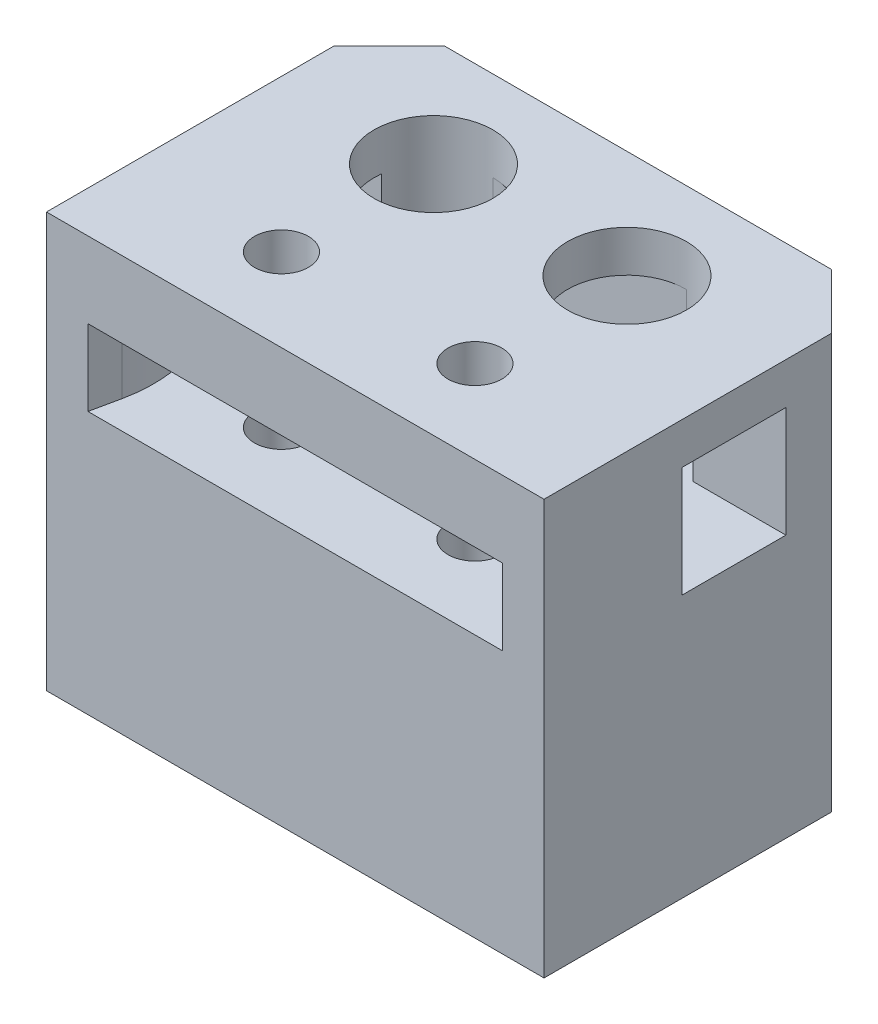
ISO-10303-21;
HEADER;
FILE_DESCRIPTION(('STEP AP214'),'2;1');
FILE_NAME('part.step','',(''),(''),'','','');
FILE_SCHEMA(('AUTOMOTIVE_DESIGN { 1 0 10303 214 1 1 1 1 }'));
ENDSEC;
DATA;
#1=APPLICATION_CONTEXT('core data for automotive mechanical design processes');
#2=APPLICATION_PROTOCOL_DEFINITION('international standard','automotive_design',2000,#1);
#3=PRODUCT_CONTEXT('',#1,'mechanical');
#4=PRODUCT('Part','Part','',(#3));
#5=PRODUCT_RELATED_PRODUCT_CATEGORY('part','',(#4));
#6=PRODUCT_DEFINITION_FORMATION('','',#4);
#7=PRODUCT_DEFINITION_CONTEXT('part definition',#1,'design');
#8=PRODUCT_DEFINITION('design','',#6,#7);
#9=PRODUCT_DEFINITION_SHAPE('','',#8);
#10=(LENGTH_UNIT() NAMED_UNIT(*) SI_UNIT(.MILLI.,.METRE.));
#11=(NAMED_UNIT(*) PLANE_ANGLE_UNIT() SI_UNIT($,.RADIAN.));
#12=(NAMED_UNIT(*) SI_UNIT($,.STERADIAN.) SOLID_ANGLE_UNIT());
#13=UNCERTAINTY_MEASURE_WITH_UNIT(LENGTH_MEASURE(1.E-05),#10,'distance_accuracy_value','');
#14=(GEOMETRIC_REPRESENTATION_CONTEXT(3) GLOBAL_UNCERTAINTY_ASSIGNED_CONTEXT((#13)) GLOBAL_UNIT_ASSIGNED_CONTEXT((#10,
#11,#12)) REPRESENTATION_CONTEXT('',''));
#15=CARTESIAN_POINT('',(0.,0.,0.));
#16=DIRECTION('',(0.,0.,1.));
#17=DIRECTION('',(1.,0.,0.));
#18=AXIS2_PLACEMENT_3D('',#15,#16,#17);
#19=CARTESIAN_POINT('',(-11.2064895830892,24.5,-17.8918774508655));
#20=DIRECTION('',(0.978253391416086,0.,0.207413360666393));
#21=DIRECTION('',(0.207413360666393,0.,-0.978253391416085));
#22=AXIS2_PLACEMENT_3D('',#19,#20,#21);
#23=PLANE('',#22);
#24=DIRECTION('',(-0.207413360666393,0.,0.978253391416085));
#25=VECTOR('',#24,1.);
#26=CARTESIAN_POINT('',(-11.2064895830892,19.,-17.8918774508655));
#27=LINE('',#26,#25);
#28=CARTESIAN_POINT('',(-14.5685460403023,19.,-2.03492821271547));
#29=VERTEX_POINT('',#28);
#30=CARTESIAN_POINT('',(-15.,19.,0.));
#31=VERTEX_POINT('',#30);
#32=EDGE_CURVE('E383',#29,#31,#27,.T.);
#33=ORIENTED_EDGE('',*,*,#32,.F.);
#34=DIRECTION('',(0.,1.,0.));
#35=VECTOR('',#34,1.);
#36=CARTESIAN_POINT('',(-14.5685460403023,24.5,-2.03492821271547));
#37=LINE('',#36,#35);
#38=CARTESIAN_POINT('',(-14.5685460403023,24.5,-2.03492821271547));
#39=VERTEX_POINT('',#38);
#40=EDGE_CURVE('E513',#29,#39,#37,.T.);
#41=ORIENTED_EDGE('',*,*,#40,.T.);
#42=DIRECTION('',(-0.207413360666393,0.,0.978253391416085));
#43=VECTOR('',#42,1.);
#44=CARTESIAN_POINT('',(-11.2064895830892,24.5,-17.8918774508655));
#45=LINE('',#44,#43);
#46=CARTESIAN_POINT('',(-15.,24.5,0.));
#47=VERTEX_POINT('',#46);
#48=EDGE_CURVE('E360',#39,#47,#45,.T.);
#49=ORIENTED_EDGE('',*,*,#48,.T.);
#50=DIRECTION('',(0.,-1.,0.));
#51=VECTOR('',#50,1.);
#52=CARTESIAN_POINT('',(-15.,24.5,0.));
#53=LINE('',#52,#51);
#54=EDGE_CURVE('E395',#47,#31,#53,.T.);
#55=ORIENTED_EDGE('',*,*,#54,.T.);
#56=EDGE_LOOP('',(#33,#41,#49,#55));
#57=FACE_BOUND('',#56,.T.);
#58=ADVANCED_FACE('F43',(#57),#23,.T.);
#59=CARTESIAN_POINT('',(11.2064895830892,24.5,-17.8918774508655));
#60=DIRECTION('',(-0.978253391416086,0.,0.207413360666393));
#61=DIRECTION('',(0.207413360666393,0.,0.978253391416085));
#62=AXIS2_PLACEMENT_3D('',#59,#60,#61);
#63=PLANE('',#62);
#64=DIRECTION('',(-0.207413360666393,0.,-0.978253391416085));
#65=VECTOR('',#64,1.);
#66=CARTESIAN_POINT('',(11.2064895830892,24.5,-17.8918774508655));
#67=LINE('',#66,#65);
#68=CARTESIAN_POINT('',(15.,24.5,0.));
#69=VERTEX_POINT('',#68);
#70=CARTESIAN_POINT('',(14.5685460403023,24.5,-2.03492821271547));
#71=VERTEX_POINT('',#70);
#72=EDGE_CURVE('E368',#69,#71,#67,.T.);
#73=ORIENTED_EDGE('',*,*,#72,.T.);
#74=DIRECTION('',(0.,-1.,0.));
#75=VECTOR('',#74,1.);
#76=CARTESIAN_POINT('',(14.5685460403023,24.5,-2.03492821271547));
#77=LINE('',#76,#75);
#78=CARTESIAN_POINT('',(14.5685460403023,19.,-2.03492821271547));
#79=VERTEX_POINT('',#78);
#80=EDGE_CURVE('E506',#71,#79,#77,.T.);
#81=ORIENTED_EDGE('',*,*,#80,.T.);
#82=DIRECTION('',(-0.207413360666393,0.,-0.978253391416085));
#83=VECTOR('',#82,1.);
#84=CARTESIAN_POINT('',(11.2064895830892,19.,-17.8918774508655));
#85=LINE('',#84,#83);
#86=CARTESIAN_POINT('',(15.,19.,0.));
#87=VERTEX_POINT('',#86);
#88=EDGE_CURVE('E364',#87,#79,#85,.T.);
#89=ORIENTED_EDGE('',*,*,#88,.F.);
#90=DIRECTION('',(0.,-1.,0.));
#91=VECTOR('',#90,1.);
#92=CARTESIAN_POINT('',(15.,24.5,0.));
#93=LINE('',#92,#91);
#94=EDGE_CURVE('E372',#69,#87,#93,.T.);
#95=ORIENTED_EDGE('',*,*,#94,.F.);
#96=EDGE_LOOP('',(#73,#81,#89,#95));
#97=FACE_BOUND('',#96,.T.);
#98=ADVANCED_FACE('F569',(#97),#63,.T.);
#99=CARTESIAN_POINT('',(7.,24.5,-17.));
#100=DIRECTION('',(0.,-1.,0.));
#101=DIRECTION('',(0.,0.,-1.));
#102=AXIS2_PLACEMENT_3D('',#99,#100,#101);
#103=PLANE('',#102);
#104=DIRECTION('',(-1.,0.,0.));
#105=VECTOR('',#104,1.);
#106=CARTESIAN_POINT('',(7.,24.5,-10.));
#107=LINE('',#106,#105);
#108=CARTESIAN_POINT('',(16.253387547576,24.5,-10.));
#109=VERTEX_POINT('',#108);
#110=CARTESIAN_POINT('',(-16.253387547576,24.5,-10.));
#111=VERTEX_POINT('',#110);
#112=EDGE_CURVE('E309',#109,#111,#107,.T.);
#113=ORIENTED_EDGE('',*,*,#112,.F.);
#114=DIRECTION('',(-0.545066212953153,0.,0.83839300062495));
#115=VECTOR('',#114,1.);
#116=CARTESIAN_POINT('',(16.253387547576,24.5,-10.));
#117=LINE('',#116,#115);
#118=CARTESIAN_POINT('',(15.9671499482137,24.5,-9.55972394891093));
#119=VERTEX_POINT('',#118);
#120=EDGE_CURVE('E495',#109,#119,#117,.T.);
#121=ORIENTED_EDGE('',*,*,#120,.T.);
#122=CARTESIAN_POINT('',(24.3510799544632,24.5,-4.1090618193794));
#123=DIRECTION('',(0.,-1.,0.));
#124=DIRECTION('',(0.,0.,-1.));
#125=AXIS2_PLACEMENT_3D('',#122,#123,#124);
#126=CIRCLE('',#125,10.);
#127=EDGE_CURVE('E522',#119,#71,#126,.F.);
#128=ORIENTED_EDGE('',*,*,#127,.T.);
#129=ORIENTED_EDGE('',*,*,#72,.F.);
#130=DIRECTION('',(1.,0.,0.));
#131=VECTOR('',#130,1.);
#132=CARTESIAN_POINT('',(15.,24.5,0.));
#133=LINE('',#132,#131);
#134=EDGE_CURVE('E363',#47,#69,#133,.T.);
#135=ORIENTED_EDGE('',*,*,#134,.F.);
#136=ORIENTED_EDGE('',*,*,#48,.F.);
#137=CARTESIAN_POINT('',(-24.3510799544632,24.5,-4.1090618193794));
#138=DIRECTION('',(0.,-1.,0.));
#139=DIRECTION('',(0.,0.,-1.));
#140=AXIS2_PLACEMENT_3D('',#137,#138,#139);
#141=CIRCLE('',#140,10.);
#142=CARTESIAN_POINT('',(-15.9671499482137,24.5,-9.55972394891093));
#143=VERTEX_POINT('',#142);
#144=EDGE_CURVE('E52',#39,#143,#141,.F.);
#145=ORIENTED_EDGE('',*,*,#144,.T.);
#146=DIRECTION('',(-0.545066212953153,0.,-0.83839300062495));
#147=VECTOR('',#146,1.);
#148=CARTESIAN_POINT('',(-16.253387547576,24.5,-10.));
#149=LINE('',#148,#147);
#150=EDGE_CURVE('E492',#143,#111,#149,.T.);
#151=ORIENTED_EDGE('',*,*,#150,.T.);
#152=EDGE_LOOP('',(#113,#121,#128,#129,#135,#136,#145,#151));
#153=FACE_BOUND('',#152,.T.);
#154=CARTESIAN_POINT('',(-7.,24.5,-6.));
#155=DIRECTION('',(0.,-1.,0.));
#156=DIRECTION('',(0.,0.,-1.));
#157=AXIS2_PLACEMENT_3D('',#154,#155,#156);
#158=CIRCLE('',#157,1.94999999999999);
#159=CARTESIAN_POINT('',(-7.,24.5,-7.94999999999999));
#160=VERTEX_POINT('',#159);
#161=EDGE_CURVE('E324',#160,#160,#158,.T.);
#162=ORIENTED_EDGE('',*,*,#161,.F.);
#163=EDGE_LOOP('',(#162));
#164=FACE_BOUND('',#163,.T.);
#165=CARTESIAN_POINT('',(7.,24.5,-6.));
#166=DIRECTION('',(0.,-1.,0.));
#167=DIRECTION('',(0.,0.,-1.));
#168=AXIS2_PLACEMENT_3D('',#165,#166,#167);
#169=CIRCLE('',#168,1.94999999999999);
#170=CARTESIAN_POINT('',(7.,24.5,-7.94999999999999));
#171=VERTEX_POINT('',#170);
#172=EDGE_CURVE('E338',#171,#171,#169,.T.);
#173=ORIENTED_EDGE('',*,*,#172,.F.);
#174=EDGE_LOOP('',(#173));
#175=FACE_BOUND('',#174,.T.);
#176=ADVANCED_FACE('F580',(#153,#164,#175),#103,.T.);
#177=CARTESIAN_POINT('',(-18.,30.,0.));
#178=DIRECTION('',(0.,0.,-1.));
#179=DIRECTION('',(-1.,0.,0.));
#180=AXIS2_PLACEMENT_3D('',#177,#178,#179);
#181=PLANE('',#180);
#182=DIRECTION('',(1.,0.,0.));
#183=VECTOR('',#182,1.);
#184=CARTESIAN_POINT('',(-18.,0.,0.));
#185=LINE('',#184,#183);
#186=CARTESIAN_POINT('',(-18.,0.,0.));
#187=VERTEX_POINT('',#186);
#188=CARTESIAN_POINT('',(18.,0.,0.));
#189=VERTEX_POINT('',#188);
#190=EDGE_CURVE('E432',#187,#189,#185,.T.);
#191=ORIENTED_EDGE('',*,*,#190,.T.);
#192=DIRECTION('',(0.,-1.,0.));
#193=VECTOR('',#192,1.);
#194=CARTESIAN_POINT('',(18.,30.,0.));
#195=LINE('',#194,#193);
#196=CARTESIAN_POINT('',(18.,30.,0.));
#197=VERTEX_POINT('',#196);
#198=EDGE_CURVE('E453',#197,#189,#195,.T.);
#199=ORIENTED_EDGE('',*,*,#198,.F.);
#200=DIRECTION('',(1.,0.,0.));
#201=VECTOR('',#200,1.);
#202=CARTESIAN_POINT('',(-18.,30.,0.));
#203=LINE('',#202,#201);
#204=CARTESIAN_POINT('',(-18.,30.,0.));
#205=VERTEX_POINT('',#204);
#206=EDGE_CURVE('E414',#205,#197,#203,.T.);
#207=ORIENTED_EDGE('',*,*,#206,.F.);
#208=DIRECTION('',(0.,-1.,0.));
#209=VECTOR('',#208,1.);
#210=CARTESIAN_POINT('',(-18.,30.,0.));
#211=LINE('',#210,#209);
#212=EDGE_CURVE('E457',#205,#187,#211,.T.);
#213=ORIENTED_EDGE('',*,*,#212,.T.);
#214=EDGE_LOOP('',(#191,#199,#207,#213));
#215=FACE_BOUND('',#214,.T.);
#216=ORIENTED_EDGE('',*,*,#134,.T.);
#217=ORIENTED_EDGE('',*,*,#94,.T.);
#218=DIRECTION('',(1.,0.,0.));
#219=VECTOR('',#218,1.);
#220=CARTESIAN_POINT('',(15.,19.,0.));
#221=LINE('',#220,#219);
#222=EDGE_CURVE('E386',#31,#87,#221,.T.);
#223=ORIENTED_EDGE('',*,*,#222,.F.);
#224=ORIENTED_EDGE('',*,*,#54,.F.);
#225=EDGE_LOOP('',(#216,#217,#223,#224));
#226=FACE_BOUND('',#225,.T.);
#227=ADVANCED_FACE('F566',(#215,#226),#181,.F.);
#228=CARTESIAN_POINT('',(-18.,30.,-20.8));
#229=DIRECTION('',(0.707106781186546,0.,0.707106781186549));
#230=DIRECTION('',(0.707106781186549,0.,-0.707106781186546));
#231=AXIS2_PLACEMENT_3D('',#228,#229,#230);
#232=PLANE('',#231);
#233=DIRECTION('',(-0.707106781186548,0.,0.707106781186546));
#234=VECTOR('',#233,1.);
#235=CARTESIAN_POINT('',(-18.,0.,-20.8));
#236=LINE('',#235,#234);
#237=CARTESIAN_POINT('',(-14.,0.,-24.8));
#238=VERTEX_POINT('',#237);
#239=CARTESIAN_POINT('',(-18.,0.,-20.8));
#240=VERTEX_POINT('',#239);
#241=EDGE_CURVE('E405',#238,#240,#236,.T.);
#242=ORIENTED_EDGE('',*,*,#241,.T.);
#243=DIRECTION('',(0.,-1.,0.));
#244=VECTOR('',#243,1.);
#245=CARTESIAN_POINT('',(-18.,30.,-20.8));
#246=LINE('',#245,#244);
#247=CARTESIAN_POINT('',(-18.,30.,-20.8));
#248=VERTEX_POINT('',#247);
#249=EDGE_CURVE('E461',#248,#240,#246,.T.);
#250=ORIENTED_EDGE('',*,*,#249,.F.);
#251=DIRECTION('',(-0.707106781186548,0.,0.707106781186546));
#252=VECTOR('',#251,1.);
#253=CARTESIAN_POINT('',(-18.,30.,-20.8));
#254=LINE('',#253,#252);
#255=CARTESIAN_POINT('',(-14.,30.,-24.8));
#256=VERTEX_POINT('',#255);
#257=EDGE_CURVE('E406',#256,#248,#254,.T.);
#258=ORIENTED_EDGE('',*,*,#257,.F.);
#259=DIRECTION('',(0.,-1.,0.));
#260=VECTOR('',#259,1.);
#261=CARTESIAN_POINT('',(-14.,30.,-24.8));
#262=LINE('',#261,#260);
#263=EDGE_CURVE('E425',#256,#238,#262,.T.);
#264=ORIENTED_EDGE('',*,*,#263,.T.);
#265=EDGE_LOOP('',(#242,#250,#258,#264));
#266=FACE_BOUND('',#265,.T.);
#267=ADVANCED_FACE('F613',(#266),#232,.F.);
#268=CARTESIAN_POINT('',(-18.,30.,0.));
#269=DIRECTION('',(1.,0.,0.));
#270=DIRECTION('',(0.,0.,-1.));
#271=AXIS2_PLACEMENT_3D('',#268,#269,#270);
#272=PLANE('',#271);
#273=DIRECTION('',(0.,0.,1.));
#274=VECTOR('',#273,1.);
#275=CARTESIAN_POINT('',(-18.,27.,-10.));
#276=LINE('',#275,#274);
#277=CARTESIAN_POINT('',(-18.,27.,-17.5));
#278=VERTEX_POINT('',#277);
#279=CARTESIAN_POINT('',(-18.,27.,-10.));
#280=VERTEX_POINT('',#279);
#281=EDGE_CURVE('E288',#278,#280,#276,.T.);
#282=ORIENTED_EDGE('',*,*,#281,.T.);
#283=DIRECTION('',(0.,-1.,0.));
#284=VECTOR('',#283,1.);
#285=CARTESIAN_POINT('',(-18.,27.,-10.));
#286=LINE('',#285,#284);
#287=CARTESIAN_POINT('',(-18.,19.,-10.));
#288=VERTEX_POINT('',#287);
#289=EDGE_CURVE('E273',#280,#288,#286,.T.);
#290=ORIENTED_EDGE('',*,*,#289,.T.);
#291=DIRECTION('',(0.,0.,-1.));
#292=VECTOR('',#291,1.);
#293=CARTESIAN_POINT('',(-18.,19.,-10.));
#294=LINE('',#293,#292);
#295=CARTESIAN_POINT('',(-18.,19.,-17.5));
#296=VERTEX_POINT('',#295);
#297=EDGE_CURVE('E280',#288,#296,#294,.T.);
#298=ORIENTED_EDGE('',*,*,#297,.T.);
#299=DIRECTION('',(0.,1.,0.));
#300=VECTOR('',#299,1.);
#301=CARTESIAN_POINT('',(-18.,27.,-17.5));
#302=LINE('',#301,#300);
#303=EDGE_CURVE('E284',#296,#278,#302,.T.);
#304=ORIENTED_EDGE('',*,*,#303,.T.);
#305=EDGE_LOOP('',(#282,#290,#298,#304));
#306=FACE_BOUND('',#305,.T.);
#307=DIRECTION('',(0.,0.,1.));
#308=VECTOR('',#307,1.);
#309=CARTESIAN_POINT('',(-18.,0.,0.));
#310=LINE('',#309,#308);
#311=EDGE_CURVE('E429',#240,#187,#310,.T.);
#312=ORIENTED_EDGE('',*,*,#311,.T.);
#313=ORIENTED_EDGE('',*,*,#212,.F.);
#314=DIRECTION('',(0.,0.,1.));
#315=VECTOR('',#314,1.);
#316=CARTESIAN_POINT('',(-18.,30.,0.));
#317=LINE('',#316,#315);
#318=EDGE_CURVE('E410',#248,#205,#317,.T.);
#319=ORIENTED_EDGE('',*,*,#318,.F.);
#320=ORIENTED_EDGE('',*,*,#249,.T.);
#321=EDGE_LOOP('',(#312,#313,#319,#320));
#322=FACE_BOUND('',#321,.T.);
#323=ADVANCED_FACE('F552',(#306,#322),#272,.F.);
#324=CARTESIAN_POINT('',(18.,30.,0.));
#325=DIRECTION('',(-1.,0.,0.));
#326=DIRECTION('',(0.,0.,1.));
#327=AXIS2_PLACEMENT_3D('',#324,#325,#326);
#328=PLANE('',#327);
#329=DIRECTION('',(0.,0.,-1.));
#330=VECTOR('',#329,1.);
#331=CARTESIAN_POINT('',(18.,19.,-10.));
#332=LINE('',#331,#330);
#333=CARTESIAN_POINT('',(18.,19.,-10.));
#334=VERTEX_POINT('',#333);
#335=CARTESIAN_POINT('',(18.,19.,-17.5));
#336=VERTEX_POINT('',#335);
#337=EDGE_CURVE('E252',#334,#336,#332,.T.);
#338=ORIENTED_EDGE('',*,*,#337,.F.);
#339=DIRECTION('',(0.,-1.,0.));
#340=VECTOR('',#339,1.);
#341=CARTESIAN_POINT('',(18.,27.,-10.));
#342=LINE('',#341,#340);
#343=CARTESIAN_POINT('',(18.,27.,-10.));
#344=VERTEX_POINT('',#343);
#345=EDGE_CURVE('E262',#344,#334,#342,.T.);
#346=ORIENTED_EDGE('',*,*,#345,.F.);
#347=DIRECTION('',(0.,0.,1.));
#348=VECTOR('',#347,1.);
#349=CARTESIAN_POINT('',(18.,27.,-10.));
#350=LINE('',#349,#348);
#351=CARTESIAN_POINT('',(18.,27.,-17.5));
#352=VERTEX_POINT('',#351);
#353=EDGE_CURVE('E267',#352,#344,#350,.T.);
#354=ORIENTED_EDGE('',*,*,#353,.F.);
#355=DIRECTION('',(0.,1.,0.));
#356=VECTOR('',#355,1.);
#357=CARTESIAN_POINT('',(18.,27.,-17.5));
#358=LINE('',#357,#356);
#359=EDGE_CURVE('E240',#336,#352,#358,.T.);
#360=ORIENTED_EDGE('',*,*,#359,.F.);
#361=EDGE_LOOP('',(#338,#346,#354,#360));
#362=FACE_BOUND('',#361,.T.);
#363=DIRECTION('',(0.,0.,-1.));
#364=VECTOR('',#363,1.);
#365=CARTESIAN_POINT('',(18.,0.,0.));
#366=LINE('',#365,#364);
#367=CARTESIAN_POINT('',(18.,0.,-20.8));
#368=VERTEX_POINT('',#367);
#369=EDGE_CURVE('E435',#189,#368,#366,.T.);
#370=ORIENTED_EDGE('',*,*,#369,.T.);
#371=DIRECTION('',(0.,-1.,0.));
#372=VECTOR('',#371,1.);
#373=CARTESIAN_POINT('',(18.,30.,-20.8));
#374=LINE('',#373,#372);
#375=CARTESIAN_POINT('',(18.,30.,-20.8));
#376=VERTEX_POINT('',#375);
#377=EDGE_CURVE('E450',#376,#368,#374,.T.);
#378=ORIENTED_EDGE('',*,*,#377,.F.);
#379=DIRECTION('',(0.,0.,-1.));
#380=VECTOR('',#379,1.);
#381=CARTESIAN_POINT('',(18.,30.,0.));
#382=LINE('',#381,#380);
#383=EDGE_CURVE('E417',#197,#376,#382,.T.);
#384=ORIENTED_EDGE('',*,*,#383,.F.);
#385=ORIENTED_EDGE('',*,*,#198,.T.);
#386=EDGE_LOOP('',(#370,#378,#384,#385));
#387=FACE_BOUND('',#386,.T.);
#388=ADVANCED_FACE('F264',(#362,#387),#328,.F.);
#389=CARTESIAN_POINT('',(18.,30.,-20.8));
#390=DIRECTION('',(-0.707106781186546,0.,0.707106781186549));
#391=DIRECTION('',(0.707106781186549,0.,0.707106781186546));
#392=AXIS2_PLACEMENT_3D('',#389,#390,#391);
#393=PLANE('',#392);
#394=DIRECTION('',(-0.707106781186548,0.,-0.707106781186546));
#395=VECTOR('',#394,1.);
#396=CARTESIAN_POINT('',(18.,0.,-20.8));
#397=LINE('',#396,#395);
#398=CARTESIAN_POINT('',(14.,0.,-24.8));
#399=VERTEX_POINT('',#398);
#400=EDGE_CURVE('E438',#368,#399,#397,.T.);
#401=ORIENTED_EDGE('',*,*,#400,.T.);
#402=DIRECTION('',(0.,-1.,0.));
#403=VECTOR('',#402,1.);
#404=CARTESIAN_POINT('',(14.,30.,-24.8));
#405=LINE('',#404,#403);
#406=CARTESIAN_POINT('',(14.,30.,-24.8));
#407=VERTEX_POINT('',#406);
#408=EDGE_CURVE('E446',#407,#399,#405,.T.);
#409=ORIENTED_EDGE('',*,*,#408,.F.);
#410=DIRECTION('',(-0.707106781186548,0.,-0.707106781186546));
#411=VECTOR('',#410,1.);
#412=CARTESIAN_POINT('',(18.,30.,-20.8));
#413=LINE('',#412,#411);
#414=EDGE_CURVE('E420',#376,#407,#413,.T.);
#415=ORIENTED_EDGE('',*,*,#414,.F.);
#416=ORIENTED_EDGE('',*,*,#377,.T.);
#417=EDGE_LOOP('',(#401,#409,#415,#416));
#418=FACE_BOUND('',#417,.T.);
#419=ADVANCED_FACE('F626',(#418),#393,.F.);
#420=CARTESIAN_POINT('',(14.,30.,-24.8));
#421=DIRECTION('',(0.,0.,1.));
#422=DIRECTION('',(1.,0.,0.));
#423=AXIS2_PLACEMENT_3D('',#420,#421,#422);
#424=PLANE('',#423);
#425=DIRECTION('',(-1.,0.,0.));
#426=VECTOR('',#425,1.);
#427=CARTESIAN_POINT('',(14.,0.,-24.8));
#428=LINE('',#427,#426);
#429=EDGE_CURVE('E411',#399,#238,#428,.T.);
#430=ORIENTED_EDGE('',*,*,#429,.T.);
#431=ORIENTED_EDGE('',*,*,#263,.F.);
#432=DIRECTION('',(-1.,0.,0.));
#433=VECTOR('',#432,1.);
#434=CARTESIAN_POINT('',(14.,30.,-24.8));
#435=LINE('',#434,#433);
#436=EDGE_CURVE('E422',#407,#256,#435,.T.);
#437=ORIENTED_EDGE('',*,*,#436,.F.);
#438=ORIENTED_EDGE('',*,*,#408,.T.);
#439=EDGE_LOOP('',(#430,#431,#437,#438));
#440=FACE_BOUND('',#439,.T.);
#441=ADVANCED_FACE('F600',(#440),#424,.F.);
#442=CARTESIAN_POINT('',(0.,30.,0.));
#443=DIRECTION('',(0.,1.,0.));
#444=DIRECTION('',(0.,0.,1.));
#445=AXIS2_PLACEMENT_3D('',#442,#443,#444);
#446=PLANE('',#445);
#447=CARTESIAN_POINT('',(-7.,30.,-6.));
#448=DIRECTION('',(0.,1.,0.));
#449=DIRECTION('',(0.,0.,1.));
#450=AXIS2_PLACEMENT_3D('',#447,#448,#449);
#451=CIRCLE('',#450,1.95);
#452=CARTESIAN_POINT('',(-7.,30.,-4.05000000000001));
#453=VERTEX_POINT('',#452);
#454=EDGE_CURVE('E316',#453,#453,#451,.T.);
#455=ORIENTED_EDGE('',*,*,#454,.F.);
#456=EDGE_LOOP('',(#455));
#457=FACE_BOUND('',#456,.T.);
#458=CARTESIAN_POINT('',(7.,30.,-6.));
#459=DIRECTION('',(0.,1.,0.));
#460=DIRECTION('',(0.,0.,1.));
#461=AXIS2_PLACEMENT_3D('',#458,#459,#460);
#462=CIRCLE('',#461,1.95);
#463=CARTESIAN_POINT('',(7.,30.,-4.05000000000001));
#464=VERTEX_POINT('',#463);
#465=EDGE_CURVE('E329',#464,#464,#462,.T.);
#466=ORIENTED_EDGE('',*,*,#465,.F.);
#467=EDGE_LOOP('',(#466));
#468=FACE_BOUND('',#467,.T.);
#469=CARTESIAN_POINT('',(-7.,30.,-17.));
#470=DIRECTION('',(0.,1.,0.));
#471=DIRECTION('',(0.,0.,1.));
#472=AXIS2_PLACEMENT_3D('',#469,#470,#471);
#473=CIRCLE('',#472,4.3);
#474=CARTESIAN_POINT('',(-7.,30.,-12.7));
#475=VERTEX_POINT('',#474);
#476=EDGE_CURVE('E342',#475,#475,#473,.T.);
#477=ORIENTED_EDGE('',*,*,#476,.F.);
#478=EDGE_LOOP('',(#477));
#479=FACE_BOUND('',#478,.T.);
#480=CARTESIAN_POINT('',(7.,30.,-17.));
#481=DIRECTION('',(0.,1.,0.));
#482=DIRECTION('',(0.,0.,1.));
#483=AXIS2_PLACEMENT_3D('',#480,#481,#482);
#484=CIRCLE('',#483,4.3);
#485=CARTESIAN_POINT('',(7.,30.,-12.7));
#486=VERTEX_POINT('',#485);
#487=EDGE_CURVE('E351',#486,#486,#484,.T.);
#488=ORIENTED_EDGE('',*,*,#487,.F.);
#489=EDGE_LOOP('',(#488));
#490=FACE_BOUND('',#489,.T.);
#491=ORIENTED_EDGE('',*,*,#257,.T.);
#492=ORIENTED_EDGE('',*,*,#318,.T.);
#493=ORIENTED_EDGE('',*,*,#206,.T.);
#494=ORIENTED_EDGE('',*,*,#383,.T.);
#495=ORIENTED_EDGE('',*,*,#414,.T.);
#496=ORIENTED_EDGE('',*,*,#436,.T.);
#497=EDGE_LOOP('',(#491,#492,#493,#494,#495,#496));
#498=FACE_BOUND('',#497,.T.);
#499=ADVANCED_FACE('F596',(#457,#468,#479,#490,#498),#446,.T.);
#500=CARTESIAN_POINT('',(0.,0.,0.));
#501=DIRECTION('',(0.,1.,0.));
#502=DIRECTION('',(0.,0.,1.));
#503=AXIS2_PLACEMENT_3D('',#500,#501,#502);
#504=PLANE('',#503);
#505=CARTESIAN_POINT('',(-7.,0.,-6.));
#506=DIRECTION('',(0.,1.,0.));
#507=DIRECTION('',(0.,0.,1.));
#508=AXIS2_PLACEMENT_3D('',#505,#506,#507);
#509=CIRCLE('',#508,1.94999999999999);
#510=CARTESIAN_POINT('',(-7.,0.,-4.05000000000001));
#511=VERTEX_POINT('',#510);
#512=EDGE_CURVE('E320',#511,#511,#509,.T.);
#513=ORIENTED_EDGE('',*,*,#512,.T.);
#514=EDGE_LOOP('',(#513));
#515=FACE_BOUND('',#514,.T.);
#516=CARTESIAN_POINT('',(7.,0.,-6.));
#517=DIRECTION('',(0.,1.,0.));
#518=DIRECTION('',(0.,0.,1.));
#519=AXIS2_PLACEMENT_3D('',#516,#517,#518);
#520=CIRCLE('',#519,1.94999999999999);
#521=CARTESIAN_POINT('',(7.,0.,-4.05000000000001));
#522=VERTEX_POINT('',#521);
#523=EDGE_CURVE('E333',#522,#522,#520,.T.);
#524=ORIENTED_EDGE('',*,*,#523,.T.);
#525=EDGE_LOOP('',(#524));
#526=FACE_BOUND('',#525,.T.);
#527=CARTESIAN_POINT('',(-7.,0.,-17.));
#528=DIRECTION('',(0.,1.,0.));
#529=DIRECTION('',(0.,0.,1.));
#530=AXIS2_PLACEMENT_3D('',#527,#528,#529);
#531=CIRCLE('',#530,2.24999999999999);
#532=CARTESIAN_POINT('',(-7.,0.,-14.75));
#533=VERTEX_POINT('',#532);
#534=EDGE_CURVE('E346',#533,#533,#531,.T.);
#535=ORIENTED_EDGE('',*,*,#534,.T.);
#536=EDGE_LOOP('',(#535));
#537=FACE_BOUND('',#536,.T.);
#538=CARTESIAN_POINT('',(7.,0.,-17.));
#539=DIRECTION('',(0.,1.,0.));
#540=DIRECTION('',(0.,0.,1.));
#541=AXIS2_PLACEMENT_3D('',#538,#539,#540);
#542=CIRCLE('',#541,2.24999999999999);
#543=CARTESIAN_POINT('',(7.,0.,-14.75));
#544=VERTEX_POINT('',#543);
#545=EDGE_CURVE('E355',#544,#544,#542,.T.);
#546=ORIENTED_EDGE('',*,*,#545,.T.);
#547=EDGE_LOOP('',(#546));
#548=FACE_BOUND('',#547,.T.);
#549=ORIENTED_EDGE('',*,*,#241,.F.);
#550=ORIENTED_EDGE('',*,*,#429,.F.);
#551=ORIENTED_EDGE('',*,*,#400,.F.);
#552=ORIENTED_EDGE('',*,*,#369,.F.);
#553=ORIENTED_EDGE('',*,*,#190,.F.);
#554=ORIENTED_EDGE('',*,*,#311,.F.);
#555=EDGE_LOOP('',(#549,#550,#551,#552,#553,#554));
#556=FACE_BOUND('',#555,.T.);
#557=ADVANCED_FACE('F599',(#515,#526,#537,#548,#556),#504,.F.);
#558=CARTESIAN_POINT('',(7.,24.5,-17.));
#559=DIRECTION('',(0.,-1.,0.));
#560=DIRECTION('',(0.,0.,-1.));
#561=AXIS2_PLACEMENT_3D('',#558,#559,#560);
#562=CYLINDRICAL_SURFACE('',#561,4.3);
#563=CARTESIAN_POINT('',(7.,19.,-17.));
#564=DIRECTION('',(0.,1.,0.));
#565=DIRECTION('',(0.,0.,-1.));
#566=AXIS2_PLACEMENT_3D('',#563,#564,#565);
#567=CIRCLE('',#566,4.3);
#568=CARTESIAN_POINT('',(11.2708313008125,19.,-17.5));
#569=VERTEX_POINT('',#568);
#570=CARTESIAN_POINT('',(7.,19.,-21.3));
#571=VERTEX_POINT('',#570);
#572=EDGE_CURVE('E373',#569,#571,#567,.T.);
#573=ORIENTED_EDGE('',*,*,#572,.F.);
#574=DIRECTION('',(0.,-1.,0.));
#575=VECTOR('',#574,1.);
#576=CARTESIAN_POINT('',(11.2708313008125,24.5,-17.5));
#577=LINE('',#576,#575);
#578=CARTESIAN_POINT('',(11.2708313008125,27.,-17.5));
#579=VERTEX_POINT('',#578);
#580=EDGE_CURVE('E243',#579,#569,#577,.T.);
#581=ORIENTED_EDGE('',*,*,#580,.F.);
#582=CARTESIAN_POINT('',(7.,27.,-17.));
#583=DIRECTION('',(0.,1.,0.));
#584=DIRECTION('',(0.,0.,1.));
#585=AXIS2_PLACEMENT_3D('',#582,#583,#584);
#586=CIRCLE('',#585,4.3);
#587=CARTESIAN_POINT('',(7.,27.,-21.3));
#588=VERTEX_POINT('',#587);
#589=EDGE_CURVE('E313',#588,#579,#586,.T.);
#590=ORIENTED_EDGE('',*,*,#589,.F.);
#591=DIRECTION('',(0.,-1.,0.));
#592=VECTOR('',#591,1.);
#593=CARTESIAN_POINT('',(7.,24.5,-21.3));
#594=LINE('',#593,#592);
#595=EDGE_CURVE('E402',#588,#571,#594,.T.);
#596=ORIENTED_EDGE('',*,*,#595,.T.);
#597=EDGE_LOOP('',(#573,#581,#590,#596));
#598=FACE_BOUND('',#597,.T.);
#599=ORIENTED_EDGE('',*,*,#487,.T.);
#600=EDGE_LOOP('',(#599));
#601=FACE_BOUND('',#600,.T.);
#602=ADVANCED_FACE('F538',(#598,#601),#562,.F.);
#603=CARTESIAN_POINT('',(-7.,24.5,-21.3));
#604=DIRECTION('',(0.,0.,1.));
#605=DIRECTION('',(1.,0.,0.));
#606=AXIS2_PLACEMENT_3D('',#603,#604,#605);
#607=PLANE('',#606);
#608=DIRECTION('',(-1.,0.,0.));
#609=VECTOR('',#608,1.);
#610=CARTESIAN_POINT('',(-7.,19.,-21.3));
#611=LINE('',#610,#609);
#612=CARTESIAN_POINT('',(-7.,19.,-21.3));
#613=VERTEX_POINT('',#612);
#614=EDGE_CURVE('E376',#571,#613,#611,.T.);
#615=ORIENTED_EDGE('',*,*,#614,.F.);
#616=ORIENTED_EDGE('',*,*,#595,.F.);
#617=DIRECTION('',(1.,0.,0.));
#618=VECTOR('',#617,1.);
#619=CARTESIAN_POINT('',(-18.,27.,-21.3));
#620=LINE('',#619,#618);
#621=CARTESIAN_POINT('',(-7.,27.,-21.3));
#622=VERTEX_POINT('',#621);
#623=EDGE_CURVE('E502',#588,#622,#620,.F.);
#624=ORIENTED_EDGE('',*,*,#623,.T.);
#625=DIRECTION('',(0.,-1.,0.));
#626=VECTOR('',#625,1.);
#627=CARTESIAN_POINT('',(-7.,24.5,-21.3));
#628=LINE('',#627,#626);
#629=EDGE_CURVE('E399',#622,#613,#628,.T.);
#630=ORIENTED_EDGE('',*,*,#629,.T.);
#631=EDGE_LOOP('',(#615,#616,#624,#630));
#632=FACE_BOUND('',#631,.T.);
#633=ADVANCED_FACE('F636',(#632),#607,.T.);
#634=CARTESIAN_POINT('',(-7.,24.5,-17.));
#635=DIRECTION('',(0.,-1.,0.));
#636=DIRECTION('',(0.,0.,-1.));
#637=AXIS2_PLACEMENT_3D('',#634,#635,#636);
#638=CYLINDRICAL_SURFACE('',#637,4.3);
#639=DIRECTION('',(0.,-1.,0.));
#640=VECTOR('',#639,1.);
#641=CARTESIAN_POINT('',(-11.2708313008125,24.5,-17.5));
#642=LINE('',#641,#640);
#643=CARTESIAN_POINT('',(-11.2708313008125,19.,-17.5));
#644=VERTEX_POINT('',#643);
#645=CARTESIAN_POINT('',(-11.2708313008125,27.,-17.5));
#646=VERTEX_POINT('',#645);
#647=EDGE_CURVE('E306',#644,#646,#642,.F.);
#648=ORIENTED_EDGE('',*,*,#647,.F.);
#649=CARTESIAN_POINT('',(-7.,19.,-17.));
#650=DIRECTION('',(0.,1.,0.));
#651=DIRECTION('',(0.,0.,1.));
#652=AXIS2_PLACEMENT_3D('',#649,#650,#651);
#653=CIRCLE('',#652,4.3);
#654=EDGE_CURVE('E380',#613,#644,#653,.T.);
#655=ORIENTED_EDGE('',*,*,#654,.F.);
#656=ORIENTED_EDGE('',*,*,#629,.F.);
#657=CARTESIAN_POINT('',(-7.,27.,-17.));
#658=DIRECTION('',(0.,1.,0.));
#659=DIRECTION('',(0.,0.,1.));
#660=AXIS2_PLACEMENT_3D('',#657,#658,#659);
#661=CIRCLE('',#660,4.3);
#662=EDGE_CURVE('E465',#646,#622,#661,.T.);
#663=ORIENTED_EDGE('',*,*,#662,.F.);
#664=EDGE_LOOP('',(#648,#655,#656,#663));
#665=FACE_BOUND('',#664,.T.);
#666=ORIENTED_EDGE('',*,*,#476,.T.);
#667=EDGE_LOOP('',(#666));
#668=FACE_BOUND('',#667,.T.);
#669=ADVANCED_FACE('F546',(#665,#668),#638,.F.);
#670=CARTESIAN_POINT('',(7.,19.,-17.));
#671=DIRECTION('',(0.,-1.,0.));
#672=DIRECTION('',(0.,0.,-1.));
#673=AXIS2_PLACEMENT_3D('',#670,#671,#672);
#674=PLANE('',#673);
#675=CARTESIAN_POINT('',(-7.,19.,-17.));
#676=DIRECTION('',(0.,-1.,0.));
#677=DIRECTION('',(0.,0.,-1.));
#678=AXIS2_PLACEMENT_3D('',#675,#676,#677);
#679=CIRCLE('',#678,2.25);
#680=CARTESIAN_POINT('',(-7.,19.,-19.25));
#681=VERTEX_POINT('',#680);
#682=EDGE_CURVE('E350',#681,#681,#679,.T.);
#683=ORIENTED_EDGE('',*,*,#682,.T.);
#684=EDGE_LOOP('',(#683));
#685=FACE_BOUND('',#684,.T.);
#686=CARTESIAN_POINT('',(7.,19.,-17.));
#687=DIRECTION('',(0.,-1.,0.));
#688=DIRECTION('',(0.,0.,-1.));
#689=AXIS2_PLACEMENT_3D('',#686,#687,#688);
#690=CIRCLE('',#689,2.25);
#691=CARTESIAN_POINT('',(7.,19.,-19.25));
#692=VERTEX_POINT('',#691);
#693=EDGE_CURVE('E359',#692,#692,#690,.T.);
#694=ORIENTED_EDGE('',*,*,#693,.T.);
#695=EDGE_LOOP('',(#694));
#696=FACE_BOUND('',#695,.T.);
#697=ORIENTED_EDGE('',*,*,#654,.T.);
#698=DIRECTION('',(1.,0.,0.));
#699=VECTOR('',#698,1.);
#700=CARTESIAN_POINT('',(-18.,19.,-17.5));
#701=LINE('',#700,#699);
#702=EDGE_CURVE('E248',#296,#644,#701,.T.);
#703=ORIENTED_EDGE('',*,*,#702,.F.);
#704=ORIENTED_EDGE('',*,*,#297,.F.);
#705=DIRECTION('',(1.,0.,0.));
#706=VECTOR('',#705,1.);
#707=CARTESIAN_POINT('',(-18.,19.,-10.));
#708=LINE('',#707,#706);
#709=CARTESIAN_POINT('',(-16.253387547576,19.,-10.));
#710=VERTEX_POINT('',#709);
#711=EDGE_CURVE('E249',#288,#710,#708,.T.);
#712=ORIENTED_EDGE('',*,*,#711,.T.);
#713=DIRECTION('',(0.545066212953153,0.,0.83839300062495));
#714=VECTOR('',#713,1.);
#715=CARTESIAN_POINT('',(-12.5437296477785,19.,-4.2939937497638));
#716=LINE('',#715,#714);
#717=CARTESIAN_POINT('',(-15.9671499482137,19.,-9.55972394891093));
#718=VERTEX_POINT('',#717);
#719=EDGE_CURVE('E489',#710,#718,#716,.T.);
#720=ORIENTED_EDGE('',*,*,#719,.T.);
#721=CARTESIAN_POINT('',(-24.3510799544632,19.,-4.1090618193794));
#722=DIRECTION('',(0.,-1.,0.));
#723=DIRECTION('',(0.,0.,-1.));
#724=AXIS2_PLACEMENT_3D('',#721,#722,#723);
#725=CIRCLE('',#724,10.);
#726=EDGE_CURVE('E11',#718,#29,#725,.T.);
#727=ORIENTED_EDGE('',*,*,#726,.T.);
#728=ORIENTED_EDGE('',*,*,#32,.T.);
#729=ORIENTED_EDGE('',*,*,#222,.T.);
#730=ORIENTED_EDGE('',*,*,#88,.T.);
#731=CARTESIAN_POINT('',(24.3510799544632,19.,-4.1090618193794));
#732=DIRECTION('',(0.,-1.,0.));
#733=DIRECTION('',(0.,0.,-1.));
#734=AXIS2_PLACEMENT_3D('',#731,#732,#733);
#735=CIRCLE('',#734,10.);
#736=CARTESIAN_POINT('',(15.9671499482137,19.,-9.55972394891093));
#737=VERTEX_POINT('',#736);
#738=EDGE_CURVE('E519',#79,#737,#735,.T.);
#739=ORIENTED_EDGE('',*,*,#738,.T.);
#740=DIRECTION('',(0.545066212953153,0.,-0.83839300062495));
#741=VECTOR('',#740,1.);
#742=CARTESIAN_POINT('',(16.7030901188218,19.,-10.6917095192028));
#743=LINE('',#742,#741);
#744=CARTESIAN_POINT('',(16.253387547576,19.,-10.));
#745=VERTEX_POINT('',#744);
#746=EDGE_CURVE('E499',#737,#745,#743,.T.);
#747=ORIENTED_EDGE('',*,*,#746,.T.);
#748=EDGE_CURVE('E257',#745,#334,#708,.T.);
#749=ORIENTED_EDGE('',*,*,#748,.T.);
#750=ORIENTED_EDGE('',*,*,#337,.T.);
#751=EDGE_CURVE('E235',#569,#336,#701,.T.);
#752=ORIENTED_EDGE('',*,*,#751,.F.);
#753=ORIENTED_EDGE('',*,*,#572,.T.);
#754=ORIENTED_EDGE('',*,*,#614,.T.);
#755=EDGE_LOOP('',(#697,#703,#704,#712,#720,#727,#728,#729,#730,#739,#747,#749,#750,#752,#753,#754));
#756=FACE_BOUND('',#755,.T.);
#757=CARTESIAN_POINT('',(7.,19.,-6.));
#758=DIRECTION('',(0.,-1.,0.));
#759=DIRECTION('',(0.,0.,-1.));
#760=AXIS2_PLACEMENT_3D('',#757,#758,#759);
#761=CIRCLE('',#760,1.94999999999999);
#762=CARTESIAN_POINT('',(7.,19.,-7.94999999999999));
#763=VERTEX_POINT('',#762);
#764=EDGE_CURVE('E337',#763,#763,#761,.T.);
#765=ORIENTED_EDGE('',*,*,#764,.T.);
#766=EDGE_LOOP('',(#765));
#767=FACE_BOUND('',#766,.T.);
#768=CARTESIAN_POINT('',(-7.,19.,-6.));
#769=DIRECTION('',(0.,-1.,0.));
#770=DIRECTION('',(0.,0.,-1.));
#771=AXIS2_PLACEMENT_3D('',#768,#769,#770);
#772=CIRCLE('',#771,1.94999999999999);
#773=CARTESIAN_POINT('',(-7.,19.,-7.94999999999999));
#774=VERTEX_POINT('',#773);
#775=EDGE_CURVE('E325',#774,#774,#772,.T.);
#776=ORIENTED_EDGE('',*,*,#775,.T.);
#777=EDGE_LOOP('',(#776));
#778=FACE_BOUND('',#777,.T.);
#779=ADVANCED_FACE('F254',(#685,#696,#756,#767,#778),#674,.F.);
#780=CARTESIAN_POINT('',(7.,30.,-17.));
#781=DIRECTION('',(0.,1.,0.));
#782=DIRECTION('',(0.,0.,1.));
#783=AXIS2_PLACEMENT_3D('',#780,#781,#782);
#784=CYLINDRICAL_SURFACE('',#783,2.25);
#785=ORIENTED_EDGE('',*,*,#545,.F.);
#786=EDGE_LOOP('',(#785));
#787=FACE_BOUND('',#786,.T.);
#788=ORIENTED_EDGE('',*,*,#693,.F.);
#789=EDGE_LOOP('',(#788));
#790=FACE_BOUND('',#789,.T.);
#791=ADVANCED_FACE('F667',(#787,#790),#784,.F.);
#792=CARTESIAN_POINT('',(-7.,30.,-17.));
#793=DIRECTION('',(0.,1.,0.));
#794=DIRECTION('',(0.,0.,1.));
#795=AXIS2_PLACEMENT_3D('',#792,#793,#794);
#796=CYLINDRICAL_SURFACE('',#795,2.25);
#797=ORIENTED_EDGE('',*,*,#534,.F.);
#798=EDGE_LOOP('',(#797));
#799=FACE_BOUND('',#798,.T.);
#800=ORIENTED_EDGE('',*,*,#682,.F.);
#801=EDGE_LOOP('',(#800));
#802=FACE_BOUND('',#801,.T.);
#803=ADVANCED_FACE('F674',(#799,#802),#796,.F.);
#804=CARTESIAN_POINT('',(7.,30.,-6.));
#805=DIRECTION('',(0.,1.,0.));
#806=DIRECTION('',(0.,0.,1.));
#807=AXIS2_PLACEMENT_3D('',#804,#805,#806);
#808=CYLINDRICAL_SURFACE('',#807,1.94999999999999);
#809=ORIENTED_EDGE('',*,*,#523,.F.);
#810=EDGE_LOOP('',(#809));
#811=FACE_BOUND('',#810,.T.);
#812=ORIENTED_EDGE('',*,*,#764,.F.);
#813=EDGE_LOOP('',(#812));
#814=FACE_BOUND('',#813,.T.);
#815=ADVANCED_FACE('F592',(#811,#814),#808,.F.);
#816=ORIENTED_EDGE('',*,*,#172,.T.);
#817=EDGE_LOOP('',(#816));
#818=FACE_BOUND('',#817,.T.);
#819=ORIENTED_EDGE('',*,*,#465,.T.);
#820=EDGE_LOOP('',(#819));
#821=FACE_BOUND('',#820,.T.);
#822=ADVANCED_FACE('F588',(#818,#821),#808,.F.);
#823=CARTESIAN_POINT('',(-7.,30.,-6.));
#824=DIRECTION('',(0.,1.,0.));
#825=DIRECTION('',(0.,0.,1.));
#826=AXIS2_PLACEMENT_3D('',#823,#824,#825);
#827=CYLINDRICAL_SURFACE('',#826,1.94999999999999);
#828=ORIENTED_EDGE('',*,*,#161,.T.);
#829=EDGE_LOOP('',(#828));
#830=FACE_BOUND('',#829,.T.);
#831=ORIENTED_EDGE('',*,*,#454,.T.);
#832=EDGE_LOOP('',(#831));
#833=FACE_BOUND('',#832,.T.);
#834=ADVANCED_FACE('F591',(#830,#833),#827,.F.);
#835=ORIENTED_EDGE('',*,*,#512,.F.);
#836=EDGE_LOOP('',(#835));
#837=FACE_BOUND('',#836,.T.);
#838=ORIENTED_EDGE('',*,*,#775,.F.);
#839=EDGE_LOOP('',(#838));
#840=FACE_BOUND('',#839,.T.);
#841=ADVANCED_FACE('F702',(#837,#840),#827,.F.);
#842=CARTESIAN_POINT('',(-18.,27.,-17.5));
#843=DIRECTION('',(0.,0.,-1.));
#844=DIRECTION('',(-1.,0.,0.));
#845=AXIS2_PLACEMENT_3D('',#842,#843,#844);
#846=PLANE('',#845);
#847=ORIENTED_EDGE('',*,*,#647,.T.);
#848=DIRECTION('',(1.,0.,0.));
#849=VECTOR('',#848,1.);
#850=CARTESIAN_POINT('',(-18.,27.,-17.5));
#851=LINE('',#850,#849);
#852=EDGE_CURVE('E295',#278,#646,#851,.T.);
#853=ORIENTED_EDGE('',*,*,#852,.F.);
#854=ORIENTED_EDGE('',*,*,#303,.F.);
#855=ORIENTED_EDGE('',*,*,#702,.T.);
#856=EDGE_LOOP('',(#847,#853,#854,#855));
#857=FACE_BOUND('',#856,.T.);
#858=ADVANCED_FACE('F550',(#857),#846,.F.);
#859=CARTESIAN_POINT('',(-18.,27.,-10.));
#860=DIRECTION('',(0.,0.,1.));
#861=DIRECTION('',(1.,0.,0.));
#862=AXIS2_PLACEMENT_3D('',#859,#860,#861);
#863=PLANE('',#862);
#864=ORIENTED_EDGE('',*,*,#112,.T.);
#865=DIRECTION('',(0.,-1.,0.));
#866=VECTOR('',#865,1.);
#867=CARTESIAN_POINT('',(-16.253387547576,19.,-10.));
#868=LINE('',#867,#866);
#869=EDGE_CURVE('E485',#111,#710,#868,.T.);
#870=ORIENTED_EDGE('',*,*,#869,.T.);
#871=ORIENTED_EDGE('',*,*,#711,.F.);
#872=ORIENTED_EDGE('',*,*,#289,.F.);
#873=DIRECTION('',(1.,0.,0.));
#874=VECTOR('',#873,1.);
#875=CARTESIAN_POINT('',(-18.,27.,-10.));
#876=LINE('',#875,#874);
#877=EDGE_CURVE('E292',#280,#344,#876,.T.);
#878=ORIENTED_EDGE('',*,*,#877,.T.);
#879=ORIENTED_EDGE('',*,*,#345,.T.);
#880=ORIENTED_EDGE('',*,*,#748,.F.);
#881=DIRECTION('',(0.,1.,0.));
#882=VECTOR('',#881,1.);
#883=CARTESIAN_POINT('',(16.253387547576,24.5,-10.));
#884=LINE('',#883,#882);
#885=EDGE_CURVE('E481',#745,#109,#884,.T.);
#886=ORIENTED_EDGE('',*,*,#885,.T.);
#887=EDGE_LOOP('',(#864,#870,#871,#872,#878,#879,#880,#886));
#888=FACE_BOUND('',#887,.T.);
#889=ADVANCED_FACE('F529',(#888),#863,.F.);
#890=CARTESIAN_POINT('',(-18.,27.,-10.));
#891=DIRECTION('',(0.,1.,0.));
#892=DIRECTION('',(0.,0.,1.));
#893=AXIS2_PLACEMENT_3D('',#890,#891,#892);
#894=PLANE('',#893);
#895=ORIENTED_EDGE('',*,*,#589,.T.);
#896=EDGE_CURVE('E298',#579,#352,#851,.T.);
#897=ORIENTED_EDGE('',*,*,#896,.T.);
#898=ORIENTED_EDGE('',*,*,#353,.T.);
#899=ORIENTED_EDGE('',*,*,#877,.F.);
#900=ORIENTED_EDGE('',*,*,#281,.F.);
#901=ORIENTED_EDGE('',*,*,#852,.T.);
#902=ORIENTED_EDGE('',*,*,#662,.T.);
#903=ORIENTED_EDGE('',*,*,#623,.F.);
#904=EDGE_LOOP('',(#895,#897,#898,#899,#900,#901,#902,#903));
#905=FACE_BOUND('',#904,.T.);
#906=ADVANCED_FACE('F534',(#905),#894,.F.);
#907=ORIENTED_EDGE('',*,*,#580,.T.);
#908=ORIENTED_EDGE('',*,*,#751,.T.);
#909=ORIENTED_EDGE('',*,*,#359,.T.);
#910=ORIENTED_EDGE('',*,*,#896,.F.);
#911=EDGE_LOOP('',(#907,#908,#909,#910));
#912=FACE_BOUND('',#911,.T.);
#913=ADVANCED_FACE('F237',(#912),#846,.F.);
#914=CARTESIAN_POINT('',(-16.253387547576,27.,-10.));
#915=DIRECTION('',(0.83839300062495,0.,-0.545066212953153));
#916=DIRECTION('',(0.,1.,0.));
#917=AXIS2_PLACEMENT_3D('',#914,#915,#916);
#918=PLANE('',#917);
#919=ORIENTED_EDGE('',*,*,#150,.F.);
#920=DIRECTION('',(0.,1.,0.));
#921=VECTOR('',#920,1.);
#922=CARTESIAN_POINT('',(-15.9671499482137,27.,-9.55972394891093));
#923=LINE('',#922,#921);
#924=EDGE_CURVE('E62',#143,#718,#923,.F.);
#925=ORIENTED_EDGE('',*,*,#924,.T.);
#926=ORIENTED_EDGE('',*,*,#719,.F.);
#927=ORIENTED_EDGE('',*,*,#869,.F.);
#928=EDGE_LOOP('',(#919,#925,#926,#927));
#929=FACE_BOUND('',#928,.T.);
#930=ADVANCED_FACE('F557',(#929),#918,.T.);
#931=CARTESIAN_POINT('',(16.253387547576,27.,-10.));
#932=DIRECTION('',(-0.83839300062495,0.,-0.545066212953153));
#933=DIRECTION('',(0.,-1.,0.));
#934=AXIS2_PLACEMENT_3D('',#931,#932,#933);
#935=PLANE('',#934);
#936=ORIENTED_EDGE('',*,*,#746,.F.);
#937=DIRECTION('',(0.,-1.,0.));
#938=VECTOR('',#937,1.);
#939=CARTESIAN_POINT('',(15.9671499482137,27.,-9.55972394891093));
#940=LINE('',#939,#938);
#941=EDGE_CURVE('E510',#737,#119,#940,.F.);
#942=ORIENTED_EDGE('',*,*,#941,.T.);
#943=ORIENTED_EDGE('',*,*,#120,.F.);
#944=ORIENTED_EDGE('',*,*,#885,.F.);
#945=EDGE_LOOP('',(#936,#942,#943,#944));
#946=FACE_BOUND('',#945,.T.);
#947=ADVANCED_FACE('F578',(#946),#935,.T.);
#948=CARTESIAN_POINT('',(24.3510799544632,24.5,-4.1090618193794));
#949=DIRECTION('',(0.,-1.,0.));
#950=DIRECTION('',(0.,0.,-1.));
#951=AXIS2_PLACEMENT_3D('',#948,#949,#950);
#952=CYLINDRICAL_SURFACE('',#951,10.);
#953=ORIENTED_EDGE('',*,*,#127,.F.);
#954=ORIENTED_EDGE('',*,*,#941,.F.);
#955=ORIENTED_EDGE('',*,*,#738,.F.);
#956=ORIENTED_EDGE('',*,*,#80,.F.);
#957=EDGE_LOOP('',(#953,#954,#955,#956));
#958=FACE_BOUND('',#957,.T.);
#959=ADVANCED_FACE('F574',(#958),#952,.T.);
#960=CARTESIAN_POINT('',(-24.3510799544632,24.5,-4.1090618193794));
#961=DIRECTION('',(0.,1.,0.));
#962=DIRECTION('',(0.,0.,1.));
#963=AXIS2_PLACEMENT_3D('',#960,#961,#962);
#964=CYLINDRICAL_SURFACE('',#963,10.);
#965=ORIENTED_EDGE('',*,*,#726,.F.);
#966=ORIENTED_EDGE('',*,*,#924,.F.);
#967=ORIENTED_EDGE('',*,*,#144,.F.);
#968=ORIENTED_EDGE('',*,*,#40,.F.);
#969=EDGE_LOOP('',(#965,#966,#967,#968));
#970=FACE_BOUND('',#969,.T.);
#971=ADVANCED_FACE('F45',(#970),#964,.T.);
#972=CLOSED_SHELL('',(#58,#98,#176,#227,#267,#323,#388,#419,#441,#499,#557,#602,#633,#669,#779,
#791,#803,#815,#822,#834,#841,#858,#889,#906,#913,#930,#947,#959,#971));
#973=MANIFOLD_SOLID_BREP('B2',#972);
#974=ADVANCED_BREP_SHAPE_REPRESENTATION('',(#18,#973),#14);
#975=SHAPE_DEFINITION_REPRESENTATION(#9,#974);
ENDSEC;
END-ISO-10303-21;
